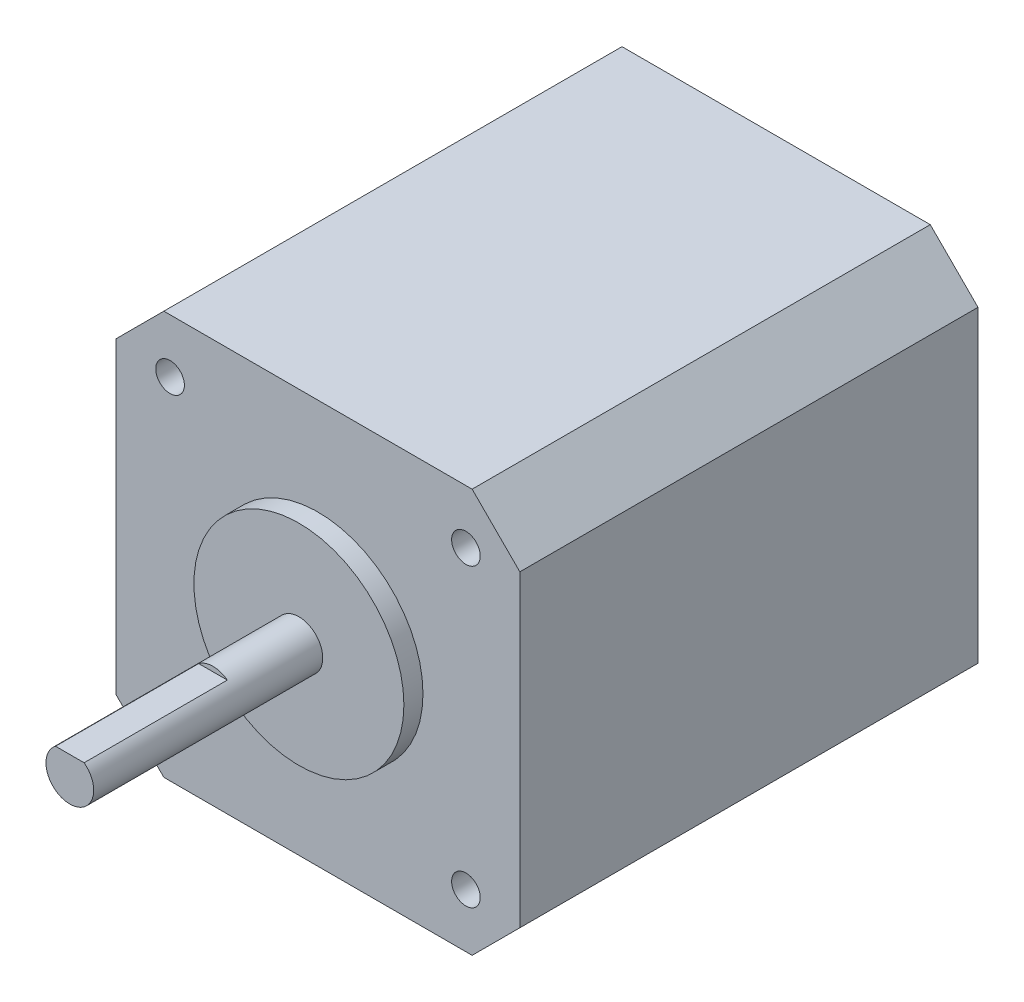
ISO-10303-21;
HEADER;
FILE_DESCRIPTION(('STEP AP214'),'2;1');
FILE_NAME('part.step','',(''),(''),'','','');
FILE_SCHEMA(('AUTOMOTIVE_DESIGN { 1 0 10303 214 1 1 1 1 }'));
ENDSEC;
DATA;
#1=APPLICATION_CONTEXT('core data for automotive mechanical design processes');
#2=APPLICATION_PROTOCOL_DEFINITION('international standard','automotive_design',2000,#1);
#3=PRODUCT_CONTEXT('',#1,'mechanical');
#4=PRODUCT('Part','Part','',(#3));
#5=PRODUCT_RELATED_PRODUCT_CATEGORY('part','',(#4));
#6=PRODUCT_DEFINITION_FORMATION('','',#4);
#7=PRODUCT_DEFINITION_CONTEXT('part definition',#1,'design');
#8=PRODUCT_DEFINITION('design','',#6,#7);
#9=PRODUCT_DEFINITION_SHAPE('','',#8);
#10=(LENGTH_UNIT() NAMED_UNIT(*) SI_UNIT(.MILLI.,.METRE.));
#11=(NAMED_UNIT(*) PLANE_ANGLE_UNIT() SI_UNIT($,.RADIAN.));
#12=(NAMED_UNIT(*) SI_UNIT($,.STERADIAN.) SOLID_ANGLE_UNIT());
#13=UNCERTAINTY_MEASURE_WITH_UNIT(LENGTH_MEASURE(1.E-05),#10,'distance_accuracy_value','');
#14=(GEOMETRIC_REPRESENTATION_CONTEXT(3) GLOBAL_UNCERTAINTY_ASSIGNED_CONTEXT((#13)) GLOBAL_UNIT_ASSIGNED_CONTEXT((#10,
#11,#12)) REPRESENTATION_CONTEXT('',''));
#15=CARTESIAN_POINT('',(0.,0.,0.));
#16=DIRECTION('',(0.,0.,1.));
#17=DIRECTION('',(1.,0.,0.));
#18=AXIS2_PLACEMENT_3D('',#15,#16,#17);
#19=CARTESIAN_POINT('',(0.,0.,0.));
#20=DIRECTION('',(0.,0.,1.));
#21=DIRECTION('',(1.,0.,0.));
#22=AXIS2_PLACEMENT_3D('',#19,#20,#21);
#23=PLANE('',#22);
#24=DIRECTION('',(0.,1.,0.));
#25=VECTOR('',#24,1.);
#26=CARTESIAN_POINT('',(0.,0.,0.));
#27=LINE('',#26,#25);
#28=CARTESIAN_POINT('',(0.,5.,0.));
#29=VERTEX_POINT('',#28);
#30=CARTESIAN_POINT('',(0.,37.3,0.));
#31=VERTEX_POINT('',#30);
#32=EDGE_CURVE('E214',#29,#31,#27,.T.);
#33=ORIENTED_EDGE('',*,*,#32,.T.);
#34=DIRECTION('',(0.707106781186548,0.707106781186547,0.));
#35=VECTOR('',#34,1.);
#36=CARTESIAN_POINT('',(-18.65,18.65,0.));
#37=LINE('',#36,#35);
#38=CARTESIAN_POINT('',(4.99999999999999,42.3,0.));
#39=VERTEX_POINT('',#38);
#40=EDGE_CURVE('E170',#31,#39,#37,.T.);
#41=ORIENTED_EDGE('',*,*,#40,.T.);
#42=DIRECTION('',(1.,0.,0.));
#43=VECTOR('',#42,1.);
#44=CARTESIAN_POINT('',(0.,42.3,0.));
#45=LINE('',#44,#43);
#46=CARTESIAN_POINT('',(37.3,42.3,0.));
#47=VERTEX_POINT('',#46);
#48=EDGE_CURVE('E232',#39,#47,#45,.T.);
#49=ORIENTED_EDGE('',*,*,#48,.T.);
#50=DIRECTION('',(0.707106781186548,-0.707106781186548,0.));
#51=VECTOR('',#50,1.);
#52=CARTESIAN_POINT('',(39.8,39.8,0.));
#53=LINE('',#52,#51);
#54=CARTESIAN_POINT('',(42.3,37.3,0.));
#55=VERTEX_POINT('',#54);
#56=EDGE_CURVE('E229',#47,#55,#53,.T.);
#57=ORIENTED_EDGE('',*,*,#56,.T.);
#58=DIRECTION('',(0.,1.,0.));
#59=VECTOR('',#58,1.);
#60=CARTESIAN_POINT('',(42.3,0.,0.));
#61=LINE('',#60,#59);
#62=CARTESIAN_POINT('',(42.3,5.,0.));
#63=VERTEX_POINT('',#62);
#64=EDGE_CURVE('E226',#63,#55,#61,.T.);
#65=ORIENTED_EDGE('',*,*,#64,.F.);
#66=DIRECTION('',(0.707106781186547,0.707106781186548,0.));
#67=VECTOR('',#66,1.);
#68=CARTESIAN_POINT('',(18.65,-18.65,0.));
#69=LINE('',#68,#67);
#70=CARTESIAN_POINT('',(37.3,0.,0.));
#71=VERTEX_POINT('',#70);
#72=EDGE_CURVE('E223',#71,#63,#69,.T.);
#73=ORIENTED_EDGE('',*,*,#72,.F.);
#74=DIRECTION('',(1.,0.,0.));
#75=VECTOR('',#74,1.);
#76=CARTESIAN_POINT('',(0.,0.,0.));
#77=LINE('',#76,#75);
#78=CARTESIAN_POINT('',(5.,0.,0.));
#79=VERTEX_POINT('',#78);
#80=EDGE_CURVE('E220',#79,#71,#77,.T.);
#81=ORIENTED_EDGE('',*,*,#80,.F.);
#82=DIRECTION('',(0.707106781186548,-0.707106781186548,0.));
#83=VECTOR('',#82,1.);
#84=CARTESIAN_POINT('',(2.5,2.5,0.));
#85=LINE('',#84,#83);
#86=EDGE_CURVE('E217',#29,#79,#85,.T.);
#87=ORIENTED_EDGE('',*,*,#86,.F.);
#88=EDGE_LOOP('',(#33,#41,#49,#57,#65,#73,#81,#87));
#89=FACE_BOUND('',#88,.T.);
#90=CARTESIAN_POINT('',(5.65,36.65,0.));
#91=DIRECTION('',(0.,0.,1.));
#92=DIRECTION('',(1.,0.,0.));
#93=AXIS2_PLACEMENT_3D('',#90,#91,#92);
#94=CIRCLE('',#93,1.5);
#95=CARTESIAN_POINT('',(7.15,36.65,0.));
#96=VERTEX_POINT('',#95);
#97=EDGE_CURVE('E211',#96,#96,#94,.T.);
#98=ORIENTED_EDGE('',*,*,#97,.T.);
#99=EDGE_LOOP('',(#98));
#100=FACE_BOUND('',#99,.T.);
#101=CARTESIAN_POINT('',(36.65,36.65,0.));
#102=DIRECTION('',(0.,0.,1.));
#103=DIRECTION('',(1.,0.,0.));
#104=AXIS2_PLACEMENT_3D('',#101,#102,#103);
#105=CIRCLE('',#104,1.5);
#106=CARTESIAN_POINT('',(38.15,36.65,0.));
#107=VERTEX_POINT('',#106);
#108=EDGE_CURVE('E208',#107,#107,#105,.T.);
#109=ORIENTED_EDGE('',*,*,#108,.T.);
#110=EDGE_LOOP('',(#109));
#111=FACE_BOUND('',#110,.T.);
#112=CARTESIAN_POINT('',(36.65,5.65,0.));
#113=DIRECTION('',(0.,0.,1.));
#114=DIRECTION('',(1.,0.,0.));
#115=AXIS2_PLACEMENT_3D('',#112,#113,#114);
#116=CIRCLE('',#115,1.5);
#117=CARTESIAN_POINT('',(38.15,5.65,0.));
#118=VERTEX_POINT('',#117);
#119=EDGE_CURVE('E205',#118,#118,#116,.T.);
#120=ORIENTED_EDGE('',*,*,#119,.T.);
#121=EDGE_LOOP('',(#120));
#122=FACE_BOUND('',#121,.T.);
#123=CARTESIAN_POINT('',(5.65,5.65,0.));
#124=DIRECTION('',(0.,0.,1.));
#125=DIRECTION('',(1.,0.,0.));
#126=AXIS2_PLACEMENT_3D('',#123,#124,#125);
#127=CIRCLE('',#126,1.5);
#128=CARTESIAN_POINT('',(7.15,5.65,0.));
#129=VERTEX_POINT('',#128);
#130=EDGE_CURVE('E163',#129,#129,#127,.T.);
#131=ORIENTED_EDGE('',*,*,#130,.T.);
#132=EDGE_LOOP('',(#131));
#133=FACE_BOUND('',#132,.T.);
#134=CARTESIAN_POINT('',(21.15,21.15,0.));
#135=DIRECTION('',(0.,0.,-1.));
#136=DIRECTION('',(-1.,0.,0.));
#137=AXIS2_PLACEMENT_3D('',#134,#135,#136);
#138=CIRCLE('',#137,2.5);
#139=CARTESIAN_POINT('',(22.65,23.15,0.));
#140=VERTEX_POINT('',#139);
#141=CARTESIAN_POINT('',(19.65,23.15,0.));
#142=VERTEX_POINT('',#141);
#143=EDGE_CURVE('E140',#140,#142,#138,.T.);
#144=ORIENTED_EDGE('',*,*,#143,.F.);
#145=DIRECTION('',(1.,0.,0.));
#146=VECTOR('',#145,1.);
#147=CARTESIAN_POINT('',(19.65,23.15,0.));
#148=LINE('',#147,#146);
#149=EDGE_CURVE('E49',#142,#140,#148,.T.);
#150=ORIENTED_EDGE('',*,*,#149,.F.);
#151=EDGE_LOOP('',(#144,#150));
#152=FACE_BOUND('',#151,.T.);
#153=ADVANCED_FACE('F34',(#89,#100,#111,#122,#133,#152),#23,.F.);
#154=CARTESIAN_POINT('',(0.,0.,48.));
#155=DIRECTION('',(-1.,0.,0.));
#156=DIRECTION('',(0.,-1.,0.));
#157=AXIS2_PLACEMENT_3D('',#154,#155,#156);
#158=PLANE('',#157);
#159=ORIENTED_EDGE('',*,*,#32,.F.);
#160=DIRECTION('',(0.,0.,-1.));
#161=VECTOR('',#160,1.);
#162=CARTESIAN_POINT('',(0.,5.,48.));
#163=LINE('',#162,#161);
#164=CARTESIAN_POINT('',(0.,5.,48.));
#165=VERTEX_POINT('',#164);
#166=EDGE_CURVE('E38',#165,#29,#163,.T.);
#167=ORIENTED_EDGE('',*,*,#166,.F.);
#168=DIRECTION('',(0.,1.,0.));
#169=VECTOR('',#168,1.);
#170=CARTESIAN_POINT('',(0.,0.,48.));
#171=LINE('',#170,#169);
#172=CARTESIAN_POINT('',(0.,37.3,48.));
#173=VERTEX_POINT('',#172);
#174=EDGE_CURVE('E179',#165,#173,#171,.T.);
#175=ORIENTED_EDGE('',*,*,#174,.T.);
#176=DIRECTION('',(0.,0.,-1.));
#177=VECTOR('',#176,1.);
#178=CARTESIAN_POINT('',(0.,37.3,48.));
#179=LINE('',#178,#177);
#180=EDGE_CURVE('E202',#173,#31,#179,.T.);
#181=ORIENTED_EDGE('',*,*,#180,.T.);
#182=EDGE_LOOP('',(#159,#167,#175,#181));
#183=FACE_BOUND('',#182,.T.);
#184=ADVANCED_FACE('F263',(#183),#158,.T.);
#185=CARTESIAN_POINT('',(2.5,2.5,48.));
#186=DIRECTION('',(0.707106781186547,0.707106781186547,0.));
#187=DIRECTION('',(-0.707106781186548,0.707106781186548,0.));
#188=AXIS2_PLACEMENT_3D('',#185,#186,#187);
#189=PLANE('',#188);
#190=ORIENTED_EDGE('',*,*,#86,.T.);
#191=DIRECTION('',(0.,0.,-1.));
#192=VECTOR('',#191,1.);
#193=CARTESIAN_POINT('',(5.,0.,48.));
#194=LINE('',#193,#192);
#195=CARTESIAN_POINT('',(5.,0.,48.));
#196=VERTEX_POINT('',#195);
#197=EDGE_CURVE('E249',#196,#79,#194,.T.);
#198=ORIENTED_EDGE('',*,*,#197,.F.);
#199=DIRECTION('',(0.707106781186548,-0.707106781186548,0.));
#200=VECTOR('',#199,1.);
#201=CARTESIAN_POINT('',(2.5,2.5,48.));
#202=LINE('',#201,#200);
#203=EDGE_CURVE('E182',#165,#196,#202,.T.);
#204=ORIENTED_EDGE('',*,*,#203,.F.);
#205=ORIENTED_EDGE('',*,*,#166,.T.);
#206=EDGE_LOOP('',(#190,#198,#204,#205));
#207=FACE_BOUND('',#206,.T.);
#208=ADVANCED_FACE('F256',(#207),#189,.F.);
#209=CARTESIAN_POINT('',(0.,0.,48.));
#210=DIRECTION('',(0.,1.,0.));
#211=DIRECTION('',(0.,0.,1.));
#212=AXIS2_PLACEMENT_3D('',#209,#210,#211);
#213=PLANE('',#212);
#214=ORIENTED_EDGE('',*,*,#80,.T.);
#215=DIRECTION('',(0.,0.,-1.));
#216=VECTOR('',#215,1.);
#217=CARTESIAN_POINT('',(37.3,0.,48.));
#218=LINE('',#217,#216);
#219=CARTESIAN_POINT('',(37.3,0.,48.));
#220=VERTEX_POINT('',#219);
#221=EDGE_CURVE('E247',#220,#71,#218,.T.);
#222=ORIENTED_EDGE('',*,*,#221,.F.);
#223=DIRECTION('',(1.,0.,0.));
#224=VECTOR('',#223,1.);
#225=CARTESIAN_POINT('',(0.,0.,48.));
#226=LINE('',#225,#224);
#227=EDGE_CURVE('E185',#196,#220,#226,.T.);
#228=ORIENTED_EDGE('',*,*,#227,.F.);
#229=ORIENTED_EDGE('',*,*,#197,.T.);
#230=EDGE_LOOP('',(#214,#222,#228,#229));
#231=FACE_BOUND('',#230,.T.);
#232=ADVANCED_FACE('F282',(#231),#213,.F.);
#233=CARTESIAN_POINT('',(18.65,-18.65,48.));
#234=DIRECTION('',(-0.707106781186548,0.707106781186547,0.));
#235=DIRECTION('',(-0.707106781186547,-0.707106781186548,0.));
#236=AXIS2_PLACEMENT_3D('',#233,#234,#235);
#237=PLANE('',#236);
#238=ORIENTED_EDGE('',*,*,#72,.T.);
#239=DIRECTION('',(0.,0.,-1.));
#240=VECTOR('',#239,1.);
#241=CARTESIAN_POINT('',(42.3,5.,48.));
#242=LINE('',#241,#240);
#243=CARTESIAN_POINT('',(42.3,5.,48.));
#244=VERTEX_POINT('',#243);
#245=EDGE_CURVE('E244',#244,#63,#242,.T.);
#246=ORIENTED_EDGE('',*,*,#245,.F.);
#247=DIRECTION('',(0.707106781186547,0.707106781186548,0.));
#248=VECTOR('',#247,1.);
#249=CARTESIAN_POINT('',(18.65,-18.65,48.));
#250=LINE('',#249,#248);
#251=EDGE_CURVE('E188',#220,#244,#250,.T.);
#252=ORIENTED_EDGE('',*,*,#251,.F.);
#253=ORIENTED_EDGE('',*,*,#221,.T.);
#254=EDGE_LOOP('',(#238,#246,#252,#253));
#255=FACE_BOUND('',#254,.T.);
#256=ADVANCED_FACE('F281',(#255),#237,.F.);
#257=CARTESIAN_POINT('',(42.3,0.,48.));
#258=DIRECTION('',(-1.,0.,0.));
#259=DIRECTION('',(0.,-1.,0.));
#260=AXIS2_PLACEMENT_3D('',#257,#258,#259);
#261=PLANE('',#260);
#262=ORIENTED_EDGE('',*,*,#64,.T.);
#263=DIRECTION('',(0.,0.,-1.));
#264=VECTOR('',#263,1.);
#265=CARTESIAN_POINT('',(42.3,37.3,48.));
#266=LINE('',#265,#264);
#267=CARTESIAN_POINT('',(42.3,37.3,48.));
#268=VERTEX_POINT('',#267);
#269=EDGE_CURVE('E242',#268,#55,#266,.T.);
#270=ORIENTED_EDGE('',*,*,#269,.F.);
#271=DIRECTION('',(0.,1.,0.));
#272=VECTOR('',#271,1.);
#273=CARTESIAN_POINT('',(42.3,0.,48.));
#274=LINE('',#273,#272);
#275=EDGE_CURVE('E191',#244,#268,#274,.T.);
#276=ORIENTED_EDGE('',*,*,#275,.F.);
#277=ORIENTED_EDGE('',*,*,#245,.T.);
#278=EDGE_LOOP('',(#262,#270,#276,#277));
#279=FACE_BOUND('',#278,.T.);
#280=ADVANCED_FACE('F277',(#279),#261,.F.);
#281=CARTESIAN_POINT('',(39.8,39.8,48.));
#282=DIRECTION('',(0.707106781186547,0.707106781186547,0.));
#283=DIRECTION('',(-0.707106781186548,0.707106781186548,0.));
#284=AXIS2_PLACEMENT_3D('',#281,#282,#283);
#285=PLANE('',#284);
#286=ORIENTED_EDGE('',*,*,#56,.F.);
#287=DIRECTION('',(0.,0.,-1.));
#288=VECTOR('',#287,1.);
#289=CARTESIAN_POINT('',(37.3,42.3,48.));
#290=LINE('',#289,#288);
#291=CARTESIAN_POINT('',(37.3,42.3,48.));
#292=VERTEX_POINT('',#291);
#293=EDGE_CURVE('E240',#292,#47,#290,.T.);
#294=ORIENTED_EDGE('',*,*,#293,.F.);
#295=DIRECTION('',(0.707106781186548,-0.707106781186548,0.));
#296=VECTOR('',#295,1.);
#297=CARTESIAN_POINT('',(39.8,39.8,48.));
#298=LINE('',#297,#296);
#299=EDGE_CURVE('E193',#292,#268,#298,.T.);
#300=ORIENTED_EDGE('',*,*,#299,.T.);
#301=ORIENTED_EDGE('',*,*,#269,.T.);
#302=EDGE_LOOP('',(#286,#294,#300,#301));
#303=FACE_BOUND('',#302,.T.);
#304=ADVANCED_FACE('F274',(#303),#285,.T.);
#305=CARTESIAN_POINT('',(0.,42.3,48.));
#306=DIRECTION('',(0.,1.,0.));
#307=DIRECTION('',(0.,0.,1.));
#308=AXIS2_PLACEMENT_3D('',#305,#306,#307);
#309=PLANE('',#308);
#310=ORIENTED_EDGE('',*,*,#48,.F.);
#311=DIRECTION('',(0.,0.,-1.));
#312=VECTOR('',#311,1.);
#313=CARTESIAN_POINT('',(4.99999999999999,42.3,48.));
#314=LINE('',#313,#312);
#315=CARTESIAN_POINT('',(4.99999999999999,42.3,48.));
#316=VERTEX_POINT('',#315);
#317=EDGE_CURVE('E238',#316,#39,#314,.T.);
#318=ORIENTED_EDGE('',*,*,#317,.F.);
#319=DIRECTION('',(1.,0.,0.));
#320=VECTOR('',#319,1.);
#321=CARTESIAN_POINT('',(0.,42.3,48.));
#322=LINE('',#321,#320);
#323=EDGE_CURVE('E196',#316,#292,#322,.T.);
#324=ORIENTED_EDGE('',*,*,#323,.T.);
#325=ORIENTED_EDGE('',*,*,#293,.T.);
#326=EDGE_LOOP('',(#310,#318,#324,#325));
#327=FACE_BOUND('',#326,.T.);
#328=ADVANCED_FACE('F270',(#327),#309,.T.);
#329=CARTESIAN_POINT('',(5.65,36.65,48.));
#330=DIRECTION('',(0.,0.,-1.));
#331=DIRECTION('',(-1.,0.,0.));
#332=AXIS2_PLACEMENT_3D('',#329,#330,#331);
#333=CYLINDRICAL_SURFACE('',#332,1.5);
#334=CARTESIAN_POINT('',(5.65,36.65,48.));
#335=DIRECTION('',(0.,0.,1.));
#336=DIRECTION('',(1.,0.,0.));
#337=AXIS2_PLACEMENT_3D('',#334,#335,#336);
#338=CIRCLE('',#337,1.5);
#339=CARTESIAN_POINT('',(7.15,36.65,48.));
#340=VERTEX_POINT('',#339);
#341=EDGE_CURVE('E176',#340,#340,#338,.T.);
#342=ORIENTED_EDGE('',*,*,#341,.T.);
#343=EDGE_LOOP('',(#342));
#344=FACE_BOUND('',#343,.T.);
#345=ORIENTED_EDGE('',*,*,#97,.F.);
#346=EDGE_LOOP('',(#345));
#347=FACE_BOUND('',#346,.T.);
#348=ADVANCED_FACE('F305',(#344,#347),#333,.F.);
#349=CARTESIAN_POINT('',(36.65,36.65,48.));
#350=DIRECTION('',(0.,0.,-1.));
#351=DIRECTION('',(-1.,0.,0.));
#352=AXIS2_PLACEMENT_3D('',#349,#350,#351);
#353=CYLINDRICAL_SURFACE('',#352,1.5);
#354=CARTESIAN_POINT('',(36.65,36.65,48.));
#355=DIRECTION('',(0.,0.,1.));
#356=DIRECTION('',(1.,0.,0.));
#357=AXIS2_PLACEMENT_3D('',#354,#355,#356);
#358=CIRCLE('',#357,1.5);
#359=CARTESIAN_POINT('',(38.15,36.65,48.));
#360=VERTEX_POINT('',#359);
#361=EDGE_CURVE('E173',#360,#360,#358,.T.);
#362=ORIENTED_EDGE('',*,*,#361,.T.);
#363=EDGE_LOOP('',(#362));
#364=FACE_BOUND('',#363,.T.);
#365=ORIENTED_EDGE('',*,*,#108,.F.);
#366=EDGE_LOOP('',(#365));
#367=FACE_BOUND('',#366,.T.);
#368=ADVANCED_FACE('F327',(#364,#367),#353,.F.);
#369=CARTESIAN_POINT('',(36.65,5.65,48.));
#370=DIRECTION('',(0.,0.,-1.));
#371=DIRECTION('',(-1.,0.,0.));
#372=AXIS2_PLACEMENT_3D('',#369,#370,#371);
#373=CYLINDRICAL_SURFACE('',#372,1.5);
#374=CARTESIAN_POINT('',(36.65,5.65,48.));
#375=DIRECTION('',(0.,0.,1.));
#376=DIRECTION('',(1.,0.,0.));
#377=AXIS2_PLACEMENT_3D('',#374,#375,#376);
#378=CIRCLE('',#377,1.5);
#379=CARTESIAN_POINT('',(38.15,5.65,48.));
#380=VERTEX_POINT('',#379);
#381=EDGE_CURVE('E169',#380,#380,#378,.T.);
#382=ORIENTED_EDGE('',*,*,#381,.T.);
#383=EDGE_LOOP('',(#382));
#384=FACE_BOUND('',#383,.T.);
#385=ORIENTED_EDGE('',*,*,#119,.F.);
#386=EDGE_LOOP('',(#385));
#387=FACE_BOUND('',#386,.T.);
#388=ADVANCED_FACE('F335',(#384,#387),#373,.F.);
#389=CARTESIAN_POINT('',(5.65,5.65,48.));
#390=DIRECTION('',(0.,0.,-1.));
#391=DIRECTION('',(-1.,0.,0.));
#392=AXIS2_PLACEMENT_3D('',#389,#390,#391);
#393=CYLINDRICAL_SURFACE('',#392,1.5);
#394=CARTESIAN_POINT('',(5.65,5.65,48.));
#395=DIRECTION('',(0.,0.,1.));
#396=DIRECTION('',(1.,0.,0.));
#397=AXIS2_PLACEMENT_3D('',#394,#395,#396);
#398=CIRCLE('',#397,1.5);
#399=CARTESIAN_POINT('',(7.15,5.65,48.));
#400=VERTEX_POINT('',#399);
#401=EDGE_CURVE('E166',#400,#400,#398,.T.);
#402=ORIENTED_EDGE('',*,*,#401,.T.);
#403=EDGE_LOOP('',(#402));
#404=FACE_BOUND('',#403,.T.);
#405=ORIENTED_EDGE('',*,*,#130,.F.);
#406=EDGE_LOOP('',(#405));
#407=FACE_BOUND('',#406,.T.);
#408=ADVANCED_FACE('F36',(#404,#407),#393,.F.);
#409=CARTESIAN_POINT('',(-18.65,18.65,48.));
#410=DIRECTION('',(-0.707106781186547,0.707106781186548,0.));
#411=DIRECTION('',(-0.707106781186548,-0.707106781186547,0.));
#412=AXIS2_PLACEMENT_3D('',#409,#410,#411);
#413=PLANE('',#412);
#414=ORIENTED_EDGE('',*,*,#40,.F.);
#415=ORIENTED_EDGE('',*,*,#180,.F.);
#416=DIRECTION('',(0.707106781186548,0.707106781186547,0.));
#417=VECTOR('',#416,1.);
#418=CARTESIAN_POINT('',(-18.65,18.65,48.));
#419=LINE('',#418,#417);
#420=EDGE_CURVE('E199',#173,#316,#419,.T.);
#421=ORIENTED_EDGE('',*,*,#420,.T.);
#422=ORIENTED_EDGE('',*,*,#317,.T.);
#423=EDGE_LOOP('',(#414,#415,#421,#422));
#424=FACE_BOUND('',#423,.T.);
#425=ADVANCED_FACE('F266',(#424),#413,.T.);
#426=CARTESIAN_POINT('',(0.,0.,48.));
#427=DIRECTION('',(0.,0.,1.));
#428=DIRECTION('',(1.,0.,0.));
#429=AXIS2_PLACEMENT_3D('',#426,#427,#428);
#430=PLANE('',#429);
#431=CARTESIAN_POINT('',(21.15,21.15,48.));
#432=DIRECTION('',(0.,0.,1.));
#433=DIRECTION('',(1.,0.,0.));
#434=AXIS2_PLACEMENT_3D('',#431,#432,#433);
#435=CIRCLE('',#434,11.);
#436=CARTESIAN_POINT('',(32.15,21.15,48.));
#437=VERTEX_POINT('',#436);
#438=EDGE_CURVE('E158',#437,#437,#435,.T.);
#439=ORIENTED_EDGE('',*,*,#438,.F.);
#440=EDGE_LOOP('',(#439));
#441=FACE_BOUND('',#440,.T.);
#442=ORIENTED_EDGE('',*,*,#401,.F.);
#443=EDGE_LOOP('',(#442));
#444=FACE_BOUND('',#443,.T.);
#445=ORIENTED_EDGE('',*,*,#381,.F.);
#446=EDGE_LOOP('',(#445));
#447=FACE_BOUND('',#446,.T.);
#448=ORIENTED_EDGE('',*,*,#361,.F.);
#449=EDGE_LOOP('',(#448));
#450=FACE_BOUND('',#449,.T.);
#451=ORIENTED_EDGE('',*,*,#341,.F.);
#452=EDGE_LOOP('',(#451));
#453=FACE_BOUND('',#452,.T.);
#454=ORIENTED_EDGE('',*,*,#174,.F.);
#455=ORIENTED_EDGE('',*,*,#203,.T.);
#456=ORIENTED_EDGE('',*,*,#227,.T.);
#457=ORIENTED_EDGE('',*,*,#251,.T.);
#458=ORIENTED_EDGE('',*,*,#275,.T.);
#459=ORIENTED_EDGE('',*,*,#299,.F.);
#460=ORIENTED_EDGE('',*,*,#323,.F.);
#461=ORIENTED_EDGE('',*,*,#420,.F.);
#462=EDGE_LOOP('',(#454,#455,#456,#457,#458,#459,#460,#461));
#463=FACE_BOUND('',#462,.T.);
#464=ADVANCED_FACE('F299',(#441,#444,#447,#450,#453,#463),#430,.T.);
#465=CARTESIAN_POINT('',(21.15,21.15,50.));
#466=DIRECTION('',(0.,0.,-1.));
#467=DIRECTION('',(-1.,0.,0.));
#468=AXIS2_PLACEMENT_3D('',#465,#466,#467);
#469=CYLINDRICAL_SURFACE('',#468,11.);
#470=CARTESIAN_POINT('',(21.15,21.15,50.));
#471=DIRECTION('',(0.,0.,1.));
#472=DIRECTION('',(1.,0.,0.));
#473=AXIS2_PLACEMENT_3D('',#470,#471,#472);
#474=CIRCLE('',#473,11.);
#475=CARTESIAN_POINT('',(32.15,21.15,50.));
#476=VERTEX_POINT('',#475);
#477=EDGE_CURVE('E160',#476,#476,#474,.T.);
#478=ORIENTED_EDGE('',*,*,#477,.F.);
#479=EDGE_LOOP('',(#478));
#480=FACE_BOUND('',#479,.T.);
#481=ORIENTED_EDGE('',*,*,#438,.T.);
#482=EDGE_LOOP('',(#481));
#483=FACE_BOUND('',#482,.T.);
#484=ADVANCED_FACE('F359',(#480,#483),#469,.T.);
#485=CARTESIAN_POINT('',(21.15,21.15,50.));
#486=DIRECTION('',(0.,0.,1.));
#487=DIRECTION('',(1.,0.,0.));
#488=AXIS2_PLACEMENT_3D('',#485,#486,#487);
#489=PLANE('',#488);
#490=CARTESIAN_POINT('',(21.15,21.15,50.));
#491=DIRECTION('',(0.,0.,1.));
#492=DIRECTION('',(1.,0.,0.));
#493=AXIS2_PLACEMENT_3D('',#490,#491,#492);
#494=CIRCLE('',#493,2.5);
#495=CARTESIAN_POINT('',(23.65,21.15,50.));
#496=VERTEX_POINT('',#495);
#497=EDGE_CURVE('E11',#496,#496,#494,.T.);
#498=ORIENTED_EDGE('',*,*,#497,.F.);
#499=EDGE_LOOP('',(#498));
#500=FACE_BOUND('',#499,.T.);
#501=ORIENTED_EDGE('',*,*,#477,.T.);
#502=EDGE_LOOP('',(#501));
#503=FACE_BOUND('',#502,.T.);
#504=ADVANCED_FACE('F366',(#500,#503),#489,.T.);
#505=CARTESIAN_POINT('',(21.15,21.15,74.));
#506=DIRECTION('',(0.,0.,-1.));
#507=DIRECTION('',(-1.,0.,0.));
#508=AXIS2_PLACEMENT_3D('',#505,#506,#507);
#509=CYLINDRICAL_SURFACE('',#508,2.5);
#510=CARTESIAN_POINT('',(21.15,21.15,74.));
#511=DIRECTION('',(0.,0.,1.));
#512=DIRECTION('',(1.,0.,0.));
#513=AXIS2_PLACEMENT_3D('',#510,#511,#512);
#514=CIRCLE('',#513,2.5);
#515=CARTESIAN_POINT('',(19.65,23.15,74.));
#516=VERTEX_POINT('',#515);
#517=CARTESIAN_POINT('',(22.65,23.15,74.));
#518=VERTEX_POINT('',#517);
#519=EDGE_CURVE('E155',#516,#518,#514,.T.);
#520=ORIENTED_EDGE('',*,*,#519,.F.);
#521=DIRECTION('',(0.,0.,1.));
#522=VECTOR('',#521,1.);
#523=CARTESIAN_POINT('',(19.65,23.15,59.));
#524=LINE('',#523,#522);
#525=CARTESIAN_POINT('',(19.65,23.15,59.));
#526=VERTEX_POINT('',#525);
#527=EDGE_CURVE('E57',#526,#516,#524,.T.);
#528=ORIENTED_EDGE('',*,*,#527,.F.);
#529=CARTESIAN_POINT('',(21.15,21.15,59.));
#530=DIRECTION('',(0.,0.,1.));
#531=DIRECTION('',(1.,0.,0.));
#532=AXIS2_PLACEMENT_3D('',#529,#530,#531);
#533=CIRCLE('',#532,2.5);
#534=CARTESIAN_POINT('',(22.65,23.15,59.));
#535=VERTEX_POINT('',#534);
#536=EDGE_CURVE('E143',#535,#526,#533,.T.);
#537=ORIENTED_EDGE('',*,*,#536,.F.);
#538=DIRECTION('',(0.,0.,1.));
#539=VECTOR('',#538,1.);
#540=CARTESIAN_POINT('',(22.65,23.15,59.));
#541=LINE('',#540,#539);
#542=EDGE_CURVE('E152',#535,#518,#541,.T.);
#543=ORIENTED_EDGE('',*,*,#542,.T.);
#544=EDGE_LOOP('',(#520,#528,#537,#543));
#545=FACE_BOUND('',#544,.T.);
#546=ORIENTED_EDGE('',*,*,#497,.T.);
#547=EDGE_LOOP('',(#546));
#548=FACE_BOUND('',#547,.T.);
#549=ADVANCED_FACE('F373',(#545,#548),#509,.T.);
#550=CARTESIAN_POINT('',(21.15,21.15,74.));
#551=DIRECTION('',(0.,0.,1.));
#552=DIRECTION('',(1.,0.,0.));
#553=AXIS2_PLACEMENT_3D('',#550,#551,#552);
#554=PLANE('',#553);
#555=DIRECTION('',(1.,0.,0.));
#556=VECTOR('',#555,1.);
#557=CARTESIAN_POINT('',(19.65,23.15,74.));
#558=LINE('',#557,#556);
#559=EDGE_CURVE('E141',#516,#518,#558,.T.);
#560=ORIENTED_EDGE('',*,*,#559,.F.);
#561=ORIENTED_EDGE('',*,*,#519,.T.);
#562=EDGE_LOOP('',(#560,#561));
#563=FACE_BOUND('',#562,.T.);
#564=ADVANCED_FACE('F381',(#563),#554,.T.);
#565=CARTESIAN_POINT('',(19.65,23.15,59.));
#566=DIRECTION('',(0.,-1.,0.));
#567=DIRECTION('',(0.,0.,-1.));
#568=AXIS2_PLACEMENT_3D('',#565,#566,#567);
#569=PLANE('',#568);
#570=ORIENTED_EDGE('',*,*,#559,.T.);
#571=ORIENTED_EDGE('',*,*,#542,.F.);
#572=DIRECTION('',(1.,0.,0.));
#573=VECTOR('',#572,1.);
#574=CARTESIAN_POINT('',(19.65,23.15,59.));
#575=LINE('',#574,#573);
#576=EDGE_CURVE('E149',#526,#535,#575,.T.);
#577=ORIENTED_EDGE('',*,*,#576,.F.);
#578=ORIENTED_EDGE('',*,*,#527,.T.);
#579=EDGE_LOOP('',(#570,#571,#577,#578));
#580=FACE_BOUND('',#579,.T.);
#581=ADVANCED_FACE('F389',(#580),#569,.F.);
#582=CARTESIAN_POINT('',(21.15,21.15,59.));
#583=DIRECTION('',(0.,0.,1.));
#584=DIRECTION('',(1.,0.,0.));
#585=AXIS2_PLACEMENT_3D('',#582,#583,#584);
#586=PLANE('',#585);
#587=ORIENTED_EDGE('',*,*,#536,.T.);
#588=ORIENTED_EDGE('',*,*,#576,.T.);
#589=EDGE_LOOP('',(#587,#588));
#590=FACE_BOUND('',#589,.T.);
#591=ADVANCED_FACE('F397',(#590),#586,.T.);
#592=CARTESIAN_POINT('',(21.15,21.15,-13.));
#593=DIRECTION('',(0.,0.,1.));
#594=DIRECTION('',(1.,0.,0.));
#595=AXIS2_PLACEMENT_3D('',#592,#593,#594);
#596=CYLINDRICAL_SURFACE('',#595,2.5);
#597=ORIENTED_EDGE('',*,*,#143,.T.);
#598=DIRECTION('',(0.,0.,1.));
#599=VECTOR('',#598,1.);
#600=CARTESIAN_POINT('',(19.65,23.15,-13.));
#601=LINE('',#600,#599);
#602=CARTESIAN_POINT('',(19.65,23.15,-13.));
#603=VERTEX_POINT('',#602);
#604=EDGE_CURVE('E128',#603,#142,#601,.T.);
#605=ORIENTED_EDGE('',*,*,#604,.F.);
#606=CARTESIAN_POINT('',(21.15,21.15,-13.));
#607=DIRECTION('',(0.,0.,-1.));
#608=DIRECTION('',(-1.,0.,0.));
#609=AXIS2_PLACEMENT_3D('',#606,#607,#608);
#610=CIRCLE('',#609,2.5);
#611=CARTESIAN_POINT('',(22.65,23.15,-13.));
#612=VERTEX_POINT('',#611);
#613=EDGE_CURVE('E134',#612,#603,#610,.T.);
#614=ORIENTED_EDGE('',*,*,#613,.F.);
#615=DIRECTION('',(0.,0.,1.));
#616=VECTOR('',#615,1.);
#617=CARTESIAN_POINT('',(22.65,23.15,-13.));
#618=LINE('',#617,#616);
#619=EDGE_CURVE('E131',#612,#140,#618,.T.);
#620=ORIENTED_EDGE('',*,*,#619,.T.);
#621=EDGE_LOOP('',(#597,#605,#614,#620));
#622=FACE_BOUND('',#621,.T.);
#623=ADVANCED_FACE('F139',(#622),#596,.T.);
#624=CARTESIAN_POINT('',(19.65,23.15,-13.));
#625=DIRECTION('',(0.,-1.,0.));
#626=DIRECTION('',(0.,0.,-1.));
#627=AXIS2_PLACEMENT_3D('',#624,#625,#626);
#628=PLANE('',#627);
#629=ORIENTED_EDGE('',*,*,#149,.T.);
#630=ORIENTED_EDGE('',*,*,#619,.F.);
#631=DIRECTION('',(1.,0.,0.));
#632=VECTOR('',#631,1.);
#633=CARTESIAN_POINT('',(19.65,23.15,-13.));
#634=LINE('',#633,#632);
#635=EDGE_CURVE('E124',#603,#612,#634,.T.);
#636=ORIENTED_EDGE('',*,*,#635,.F.);
#637=ORIENTED_EDGE('',*,*,#604,.T.);
#638=EDGE_LOOP('',(#629,#630,#636,#637));
#639=FACE_BOUND('',#638,.T.);
#640=ADVANCED_FACE('F126',(#639),#628,.F.);
#641=CARTESIAN_POINT('',(21.15,21.15,-13.));
#642=DIRECTION('',(0.,0.,-1.));
#643=DIRECTION('',(-1.,0.,0.));
#644=AXIS2_PLACEMENT_3D('',#641,#642,#643);
#645=PLANE('',#644);
#646=ORIENTED_EDGE('',*,*,#613,.T.);
#647=ORIENTED_EDGE('',*,*,#635,.T.);
#648=EDGE_LOOP('',(#646,#647));
#649=FACE_BOUND('',#648,.T.);
#650=ADVANCED_FACE('F136',(#649),#645,.T.);
#651=CLOSED_SHELL('',(#153,#184,#208,#232,#256,#280,#304,#328,#348,#368,#388,#408,#425,#464,
#484,#504,#549,#564,#581,#591,#623,#640,#650));
#652=MANIFOLD_SOLID_BREP('B2',#651);
#653=ADVANCED_BREP_SHAPE_REPRESENTATION('',(#18,#652),#14);
#654=SHAPE_DEFINITION_REPRESENTATION(#9,#653);
ENDSEC;
END-ISO-10303-21;
